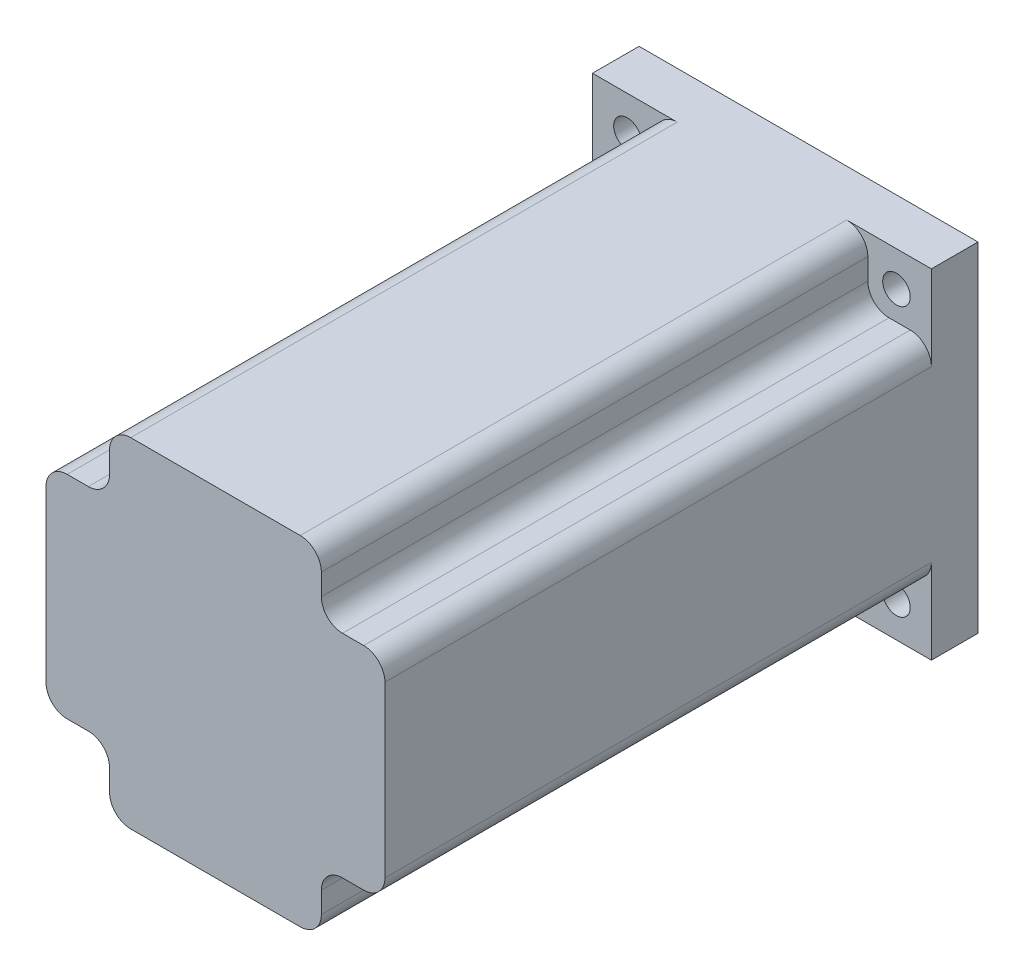
ISO-10303-21;
HEADER;
FILE_DESCRIPTION(('STEP AP214'),'2;1');
FILE_NAME('part.step','',(''),(''),'','','');
FILE_SCHEMA(('AUTOMOTIVE_DESIGN { 1 0 10303 214 1 1 1 1 }'));
ENDSEC;
DATA;
#1=APPLICATION_CONTEXT('core data for automotive mechanical design processes');
#2=APPLICATION_PROTOCOL_DEFINITION('international standard','automotive_design',2000,#1);
#3=PRODUCT_CONTEXT('',#1,'mechanical');
#4=PRODUCT('Part','Part','',(#3));
#5=PRODUCT_RELATED_PRODUCT_CATEGORY('part','',(#4));
#6=PRODUCT_DEFINITION_FORMATION('','',#4);
#7=PRODUCT_DEFINITION_CONTEXT('part definition',#1,'design');
#8=PRODUCT_DEFINITION('design','',#6,#7);
#9=PRODUCT_DEFINITION_SHAPE('','',#8);
#10=(LENGTH_UNIT() NAMED_UNIT(*) SI_UNIT(.MILLI.,.METRE.));
#11=(NAMED_UNIT(*) PLANE_ANGLE_UNIT() SI_UNIT($,.RADIAN.));
#12=(NAMED_UNIT(*) SI_UNIT($,.STERADIAN.) SOLID_ANGLE_UNIT());
#13=UNCERTAINTY_MEASURE_WITH_UNIT(LENGTH_MEASURE(1.E-05),#10,'distance_accuracy_value','');
#14=(GEOMETRIC_REPRESENTATION_CONTEXT(3) GLOBAL_UNCERTAINTY_ASSIGNED_CONTEXT((#13)) GLOBAL_UNIT_ASSIGNED_CONTEXT((#10,
#11,#12)) REPRESENTATION_CONTEXT('',''));
#15=CARTESIAN_POINT('',(0.,0.,0.));
#16=DIRECTION('',(0.,0.,1.));
#17=DIRECTION('',(1.,0.,0.));
#18=AXIS2_PLACEMENT_3D('',#15,#16,#17);
#19=CARTESIAN_POINT('',(-40.,-40.,140.));
#20=DIRECTION('',(1.,0.,0.));
#21=DIRECTION('',(0.,0.,-1.));
#22=AXIS2_PLACEMENT_3D('',#19,#20,#21);
#23=PLANE('',#22);
#24=DIRECTION('',(0.,0.,1.));
#25=VECTOR('',#24,1.);
#26=CARTESIAN_POINT('',(-40.,20.,11.));
#27=LINE('',#26,#25);
#28=CARTESIAN_POINT('',(-40.,20.,11.));
#29=VERTEX_POINT('',#28);
#30=CARTESIAN_POINT('',(-40.,20.,140.));
#31=VERTEX_POINT('',#30);
#32=EDGE_CURVE('E237',#29,#31,#27,.T.);
#33=ORIENTED_EDGE('',*,*,#32,.F.);
#34=DIRECTION('',(0.,-1.,0.));
#35=VECTOR('',#34,1.);
#36=CARTESIAN_POINT('',(-40.,-40.,11.));
#37=LINE('',#36,#35);
#38=CARTESIAN_POINT('',(-40.,40.,11.));
#39=VERTEX_POINT('',#38);
#40=EDGE_CURVE('E220',#39,#29,#37,.T.);
#41=ORIENTED_EDGE('',*,*,#40,.F.);
#42=DIRECTION('',(0.,0.,-1.));
#43=VECTOR('',#42,1.);
#44=CARTESIAN_POINT('',(-40.,40.,140.));
#45=LINE('',#44,#43);
#46=CARTESIAN_POINT('',(-40.,40.,0.));
#47=VERTEX_POINT('',#46);
#48=EDGE_CURVE('E287',#39,#47,#45,.T.);
#49=ORIENTED_EDGE('',*,*,#48,.T.);
#50=DIRECTION('',(0.,-1.,0.));
#51=VECTOR('',#50,1.);
#52=CARTESIAN_POINT('',(-40.,-40.,0.));
#53=LINE('',#52,#51);
#54=CARTESIAN_POINT('',(-40.,-40.,0.));
#55=VERTEX_POINT('',#54);
#56=EDGE_CURVE('E279',#47,#55,#53,.T.);
#57=ORIENTED_EDGE('',*,*,#56,.T.);
#58=DIRECTION('',(0.,0.,-1.));
#59=VECTOR('',#58,1.);
#60=CARTESIAN_POINT('',(-40.,-40.,140.));
#61=LINE('',#60,#59);
#62=CARTESIAN_POINT('',(-40.,-40.,11.));
#63=VERTEX_POINT('',#62);
#64=EDGE_CURVE('E285',#63,#55,#61,.T.);
#65=ORIENTED_EDGE('',*,*,#64,.F.);
#66=CARTESIAN_POINT('',(-40.,-20.,11.));
#67=VERTEX_POINT('',#66);
#68=EDGE_CURVE('E232',#67,#63,#37,.T.);
#69=ORIENTED_EDGE('',*,*,#68,.F.);
#70=DIRECTION('',(0.,0.,1.));
#71=VECTOR('',#70,1.);
#72=CARTESIAN_POINT('',(-40.,-20.,11.));
#73=LINE('',#72,#71);
#74=CARTESIAN_POINT('',(-40.,-20.,140.));
#75=VERTEX_POINT('',#74);
#76=EDGE_CURVE('E247',#67,#75,#73,.T.);
#77=ORIENTED_EDGE('',*,*,#76,.T.);
#78=DIRECTION('',(0.,-1.,0.));
#79=VECTOR('',#78,1.);
#80=CARTESIAN_POINT('',(-40.,-40.,140.));
#81=LINE('',#80,#79);
#82=EDGE_CURVE('E246',#31,#75,#81,.T.);
#83=ORIENTED_EDGE('',*,*,#82,.F.);
#84=EDGE_LOOP('',(#33,#41,#49,#57,#65,#69,#77,#83));
#85=FACE_BOUND('',#84,.T.);
#86=ADVANCED_FACE('F36',(#85),#23,.F.);
#87=CARTESIAN_POINT('',(0.,0.,140.));
#88=DIRECTION('',(0.,0.,-1.));
#89=DIRECTION('',(-1.,0.,0.));
#90=AXIS2_PLACEMENT_3D('',#87,#88,#89);
#91=PLANE('',#90);
#92=CARTESIAN_POINT('',(-35.,20.,140.));
#93=DIRECTION('',(0.,0.,1.));
#94=DIRECTION('',(1.,0.,0.));
#95=AXIS2_PLACEMENT_3D('',#92,#93,#94);
#96=CIRCLE('',#95,5.);
#97=CARTESIAN_POINT('',(-35.,25.,140.));
#98=VERTEX_POINT('',#97);
#99=EDGE_CURVE('E391',#98,#31,#96,.T.);
#100=ORIENTED_EDGE('',*,*,#99,.T.);
#101=ORIENTED_EDGE('',*,*,#82,.T.);
#102=CARTESIAN_POINT('',(-35.,-20.,140.));
#103=DIRECTION('',(0.,0.,1.));
#104=DIRECTION('',(-1.,0.,0.));
#105=AXIS2_PLACEMENT_3D('',#102,#103,#104);
#106=CIRCLE('',#105,5.);
#107=CARTESIAN_POINT('',(-35.,-25.,140.));
#108=VERTEX_POINT('',#107);
#109=EDGE_CURVE('E382',#75,#108,#106,.T.);
#110=ORIENTED_EDGE('',*,*,#109,.T.);
#111=DIRECTION('',(1.,0.,0.));
#112=VECTOR('',#111,1.);
#113=CARTESIAN_POINT('',(-30.,-25.,140.));
#114=LINE('',#113,#112);
#115=CARTESIAN_POINT('',(-30.,-25.,140.));
#116=VERTEX_POINT('',#115);
#117=EDGE_CURVE('E390',#108,#116,#114,.T.);
#118=ORIENTED_EDGE('',*,*,#117,.T.);
#119=CARTESIAN_POINT('',(-30.,-30.,140.));
#120=DIRECTION('',(0.,0.,-1.));
#121=DIRECTION('',(1.,0.,0.));
#122=AXIS2_PLACEMENT_3D('',#119,#120,#121);
#123=CIRCLE('',#122,5.);
#124=CARTESIAN_POINT('',(-25.,-30.,140.));
#125=VERTEX_POINT('',#124);
#126=EDGE_CURVE('E393',#116,#125,#123,.T.);
#127=ORIENTED_EDGE('',*,*,#126,.T.);
#128=DIRECTION('',(0.,-1.,0.));
#129=VECTOR('',#128,1.);
#130=CARTESIAN_POINT('',(-25.,-30.,140.));
#131=LINE('',#130,#129);
#132=CARTESIAN_POINT('',(-25.,-35.,140.));
#133=VERTEX_POINT('',#132);
#134=EDGE_CURVE('E399',#125,#133,#131,.T.);
#135=ORIENTED_EDGE('',*,*,#134,.T.);
#136=CARTESIAN_POINT('',(-20.,-35.,140.));
#137=DIRECTION('',(0.,0.,1.));
#138=DIRECTION('',(1.,0.,0.));
#139=AXIS2_PLACEMENT_3D('',#136,#137,#138);
#140=CIRCLE('',#139,5.);
#141=CARTESIAN_POINT('',(-20.,-40.,140.));
#142=VERTEX_POINT('',#141);
#143=EDGE_CURVE('E402',#133,#142,#140,.T.);
#144=ORIENTED_EDGE('',*,*,#143,.T.);
#145=DIRECTION('',(1.,0.,0.));
#146=VECTOR('',#145,1.);
#147=CARTESIAN_POINT('',(-40.,-40.,140.));
#148=LINE('',#147,#146);
#149=CARTESIAN_POINT('',(20.,-40.,140.));
#150=VERTEX_POINT('',#149);
#151=EDGE_CURVE('E269',#142,#150,#148,.T.);
#152=ORIENTED_EDGE('',*,*,#151,.T.);
#153=CARTESIAN_POINT('',(20.,-35.,140.));
#154=DIRECTION('',(0.,0.,1.));
#155=DIRECTION('',(-1.,0.,0.));
#156=AXIS2_PLACEMENT_3D('',#153,#154,#155);
#157=CIRCLE('',#156,5.);
#158=CARTESIAN_POINT('',(25.,-35.,140.));
#159=VERTEX_POINT('',#158);
#160=EDGE_CURVE('E405',#150,#159,#157,.T.);
#161=ORIENTED_EDGE('',*,*,#160,.T.);
#162=DIRECTION('',(0.,1.,0.));
#163=VECTOR('',#162,1.);
#164=CARTESIAN_POINT('',(25.,-30.0000000000001,140.));
#165=LINE('',#164,#163);
#166=CARTESIAN_POINT('',(25.,-30.0000000000001,140.));
#167=VERTEX_POINT('',#166);
#168=EDGE_CURVE('E408',#159,#167,#165,.T.);
#169=ORIENTED_EDGE('',*,*,#168,.T.);
#170=CARTESIAN_POINT('',(30.,-30.,140.));
#171=DIRECTION('',(0.,0.,-1.));
#172=DIRECTION('',(-1.,0.,0.));
#173=AXIS2_PLACEMENT_3D('',#170,#171,#172);
#174=CIRCLE('',#173,5.);
#175=CARTESIAN_POINT('',(30.,-25.0000000000001,140.));
#176=VERTEX_POINT('',#175);
#177=EDGE_CURVE('E411',#167,#176,#174,.T.);
#178=ORIENTED_EDGE('',*,*,#177,.T.);
#179=DIRECTION('',(1.,0.,0.));
#180=VECTOR('',#179,1.);
#181=CARTESIAN_POINT('',(30.,-25.0000000000001,140.));
#182=LINE('',#181,#180);
#183=CARTESIAN_POINT('',(35.,-25.0000000000001,140.));
#184=VERTEX_POINT('',#183);
#185=EDGE_CURVE('E414',#176,#184,#182,.T.);
#186=ORIENTED_EDGE('',*,*,#185,.T.);
#187=CARTESIAN_POINT('',(35.,-20.,140.));
#188=DIRECTION('',(0.,0.,1.));
#189=DIRECTION('',(1.,0.,0.));
#190=AXIS2_PLACEMENT_3D('',#187,#188,#189);
#191=CIRCLE('',#190,5.);
#192=CARTESIAN_POINT('',(40.,-20.,140.));
#193=VERTEX_POINT('',#192);
#194=EDGE_CURVE('E417',#184,#193,#191,.T.);
#195=ORIENTED_EDGE('',*,*,#194,.T.);
#196=DIRECTION('',(0.,1.,0.));
#197=VECTOR('',#196,1.);
#198=CARTESIAN_POINT('',(40.,-40.,140.));
#199=LINE('',#198,#197);
#200=CARTESIAN_POINT('',(40.,20.,140.));
#201=VERTEX_POINT('',#200);
#202=EDGE_CURVE('E261',#193,#201,#199,.T.);
#203=ORIENTED_EDGE('',*,*,#202,.T.);
#204=CARTESIAN_POINT('',(35.,20.0000000000001,140.));
#205=DIRECTION('',(0.,0.,1.));
#206=DIRECTION('',(-1.,0.,0.));
#207=AXIS2_PLACEMENT_3D('',#204,#205,#206);
#208=CIRCLE('',#207,5.);
#209=CARTESIAN_POINT('',(35.,25.,140.));
#210=VERTEX_POINT('',#209);
#211=EDGE_CURVE('E420',#201,#210,#208,.T.);
#212=ORIENTED_EDGE('',*,*,#211,.T.);
#213=DIRECTION('',(-1.,0.,0.));
#214=VECTOR('',#213,1.);
#215=CARTESIAN_POINT('',(30.,25.,140.));
#216=LINE('',#215,#214);
#217=CARTESIAN_POINT('',(30.,25.,140.));
#218=VERTEX_POINT('',#217);
#219=EDGE_CURVE('E59',#210,#218,#216,.T.);
#220=ORIENTED_EDGE('',*,*,#219,.T.);
#221=CARTESIAN_POINT('',(30.,30.,140.));
#222=DIRECTION('',(0.,0.,-1.));
#223=DIRECTION('',(-1.,0.,0.));
#224=AXIS2_PLACEMENT_3D('',#221,#222,#223);
#225=CIRCLE('',#224,5.);
#226=CARTESIAN_POINT('',(25.,30.0000000000001,140.));
#227=VERTEX_POINT('',#226);
#228=EDGE_CURVE('E424',#218,#227,#225,.T.);
#229=ORIENTED_EDGE('',*,*,#228,.T.);
#230=DIRECTION('',(0.,1.,0.));
#231=VECTOR('',#230,1.);
#232=CARTESIAN_POINT('',(25.,30.0000000000001,140.));
#233=LINE('',#232,#231);
#234=CARTESIAN_POINT('',(25.,35.,140.));
#235=VERTEX_POINT('',#234);
#236=EDGE_CURVE('E427',#227,#235,#233,.T.);
#237=ORIENTED_EDGE('',*,*,#236,.T.);
#238=CARTESIAN_POINT('',(20.,35.,140.));
#239=DIRECTION('',(0.,0.,1.));
#240=DIRECTION('',(1.,0.,0.));
#241=AXIS2_PLACEMENT_3D('',#238,#239,#240);
#242=CIRCLE('',#241,5.);
#243=CARTESIAN_POINT('',(20.,40.,140.));
#244=VERTEX_POINT('',#243);
#245=EDGE_CURVE('E430',#235,#244,#242,.T.);
#246=ORIENTED_EDGE('',*,*,#245,.T.);
#247=DIRECTION('',(-1.,0.,0.));
#248=VECTOR('',#247,1.);
#249=CARTESIAN_POINT('',(-40.,40.,140.));
#250=LINE('',#249,#248);
#251=CARTESIAN_POINT('',(-20.,40.,140.));
#252=VERTEX_POINT('',#251);
#253=EDGE_CURVE('E264',#244,#252,#250,.T.);
#254=ORIENTED_EDGE('',*,*,#253,.T.);
#255=CARTESIAN_POINT('',(-20.,35.,140.));
#256=DIRECTION('',(0.,0.,1.));
#257=DIRECTION('',(-1.,0.,0.));
#258=AXIS2_PLACEMENT_3D('',#255,#256,#257);
#259=CIRCLE('',#258,5.);
#260=CARTESIAN_POINT('',(-25.,35.,140.));
#261=VERTEX_POINT('',#260);
#262=EDGE_CURVE('E432',#252,#261,#259,.T.);
#263=ORIENTED_EDGE('',*,*,#262,.T.);
#264=DIRECTION('',(0.,-1.,0.));
#265=VECTOR('',#264,1.);
#266=CARTESIAN_POINT('',(-25.,30.,140.));
#267=LINE('',#266,#265);
#268=CARTESIAN_POINT('',(-25.,30.,140.));
#269=VERTEX_POINT('',#268);
#270=EDGE_CURVE('E51',#261,#269,#267,.T.);
#271=ORIENTED_EDGE('',*,*,#270,.T.);
#272=CARTESIAN_POINT('',(-30.,30.,140.));
#273=DIRECTION('',(0.,0.,-1.));
#274=DIRECTION('',(1.,0.,0.));
#275=AXIS2_PLACEMENT_3D('',#272,#273,#274);
#276=CIRCLE('',#275,5.);
#277=CARTESIAN_POINT('',(-30.,25.,140.));
#278=VERTEX_POINT('',#277);
#279=EDGE_CURVE('E436',#269,#278,#276,.T.);
#280=ORIENTED_EDGE('',*,*,#279,.T.);
#281=DIRECTION('',(-1.,0.,0.));
#282=VECTOR('',#281,1.);
#283=CARTESIAN_POINT('',(-30.,25.,140.));
#284=LINE('',#283,#282);
#285=EDGE_CURVE('E241',#278,#98,#284,.T.);
#286=ORIENTED_EDGE('',*,*,#285,.T.);
#287=EDGE_LOOP('',(#100,#101,#110,#118,#127,#135,#144,#152,#161,#169,#178,#186,#195,#203,#212,
#220,#229,#237,#246,#254,#263,#271,#280,#286));
#288=FACE_BOUND('',#287,.T.);
#289=ADVANCED_FACE('F388',(#288),#91,.F.);
#290=CARTESIAN_POINT('',(40.,-40.,140.));
#291=DIRECTION('',(-1.,0.,0.));
#292=DIRECTION('',(0.,0.,1.));
#293=AXIS2_PLACEMENT_3D('',#290,#291,#292);
#294=PLANE('',#293);
#295=DIRECTION('',(0.,0.,1.));
#296=VECTOR('',#295,1.);
#297=CARTESIAN_POINT('',(40.,-20.,11.));
#298=LINE('',#297,#296);
#299=CARTESIAN_POINT('',(40.,-20.,11.));
#300=VERTEX_POINT('',#299);
#301=EDGE_CURVE('E309',#300,#193,#298,.T.);
#302=ORIENTED_EDGE('',*,*,#301,.F.);
#303=DIRECTION('',(0.,1.,0.));
#304=VECTOR('',#303,1.);
#305=CARTESIAN_POINT('',(40.,-40.,11.));
#306=LINE('',#305,#304);
#307=CARTESIAN_POINT('',(40.,-40.,11.));
#308=VERTEX_POINT('',#307);
#309=EDGE_CURVE('E256',#308,#300,#306,.T.);
#310=ORIENTED_EDGE('',*,*,#309,.F.);
#311=DIRECTION('',(0.,0.,-1.));
#312=VECTOR('',#311,1.);
#313=CARTESIAN_POINT('',(40.,-40.,140.));
#314=LINE('',#313,#312);
#315=CARTESIAN_POINT('',(40.,-40.,0.));
#316=VERTEX_POINT('',#315);
#317=EDGE_CURVE('E272',#308,#316,#314,.T.);
#318=ORIENTED_EDGE('',*,*,#317,.T.);
#319=DIRECTION('',(0.,1.,0.));
#320=VECTOR('',#319,1.);
#321=CARTESIAN_POINT('',(40.,-40.,0.));
#322=LINE('',#321,#320);
#323=CARTESIAN_POINT('',(40.,40.,0.));
#324=VERTEX_POINT('',#323);
#325=EDGE_CURVE('E273',#316,#324,#322,.T.);
#326=ORIENTED_EDGE('',*,*,#325,.T.);
#327=DIRECTION('',(0.,0.,-1.));
#328=VECTOR('',#327,1.);
#329=CARTESIAN_POINT('',(40.,40.,140.));
#330=LINE('',#329,#328);
#331=CARTESIAN_POINT('',(40.,40.,11.));
#332=VERTEX_POINT('',#331);
#333=EDGE_CURVE('E288',#332,#324,#330,.T.);
#334=ORIENTED_EDGE('',*,*,#333,.F.);
#335=CARTESIAN_POINT('',(40.,20.,11.));
#336=VERTEX_POINT('',#335);
#337=EDGE_CURVE('E257',#336,#332,#306,.T.);
#338=ORIENTED_EDGE('',*,*,#337,.F.);
#339=DIRECTION('',(0.,0.,1.));
#340=VECTOR('',#339,1.);
#341=CARTESIAN_POINT('',(40.,20.,11.));
#342=LINE('',#341,#340);
#343=EDGE_CURVE('E321',#336,#201,#342,.T.);
#344=ORIENTED_EDGE('',*,*,#343,.T.);
#345=ORIENTED_EDGE('',*,*,#202,.F.);
#346=EDGE_LOOP('',(#302,#310,#318,#326,#334,#338,#344,#345));
#347=FACE_BOUND('',#346,.T.);
#348=ADVANCED_FACE('F38',(#347),#294,.F.);
#349=CARTESIAN_POINT('',(-40.,40.,140.));
#350=DIRECTION('',(0.,-1.,0.));
#351=DIRECTION('',(0.,0.,-1.));
#352=AXIS2_PLACEMENT_3D('',#349,#350,#351);
#353=PLANE('',#352);
#354=DIRECTION('',(0.,0.,1.));
#355=VECTOR('',#354,1.);
#356=CARTESIAN_POINT('',(20.,40.,11.));
#357=LINE('',#356,#355);
#358=CARTESIAN_POINT('',(20.,40.,11.));
#359=VERTEX_POINT('',#358);
#360=EDGE_CURVE('E334',#359,#244,#357,.T.);
#361=ORIENTED_EDGE('',*,*,#360,.F.);
#362=DIRECTION('',(-1.,0.,0.));
#363=VECTOR('',#362,1.);
#364=CARTESIAN_POINT('',(-40.,40.,11.));
#365=LINE('',#364,#363);
#366=EDGE_CURVE('E260',#332,#359,#365,.T.);
#367=ORIENTED_EDGE('',*,*,#366,.F.);
#368=ORIENTED_EDGE('',*,*,#333,.T.);
#369=DIRECTION('',(-1.,0.,0.));
#370=VECTOR('',#369,1.);
#371=CARTESIAN_POINT('',(-40.,40.,0.));
#372=LINE('',#371,#370);
#373=EDGE_CURVE('E276',#324,#47,#372,.T.);
#374=ORIENTED_EDGE('',*,*,#373,.T.);
#375=ORIENTED_EDGE('',*,*,#48,.F.);
#376=CARTESIAN_POINT('',(-20.,40.,11.));
#377=VERTEX_POINT('',#376);
#378=EDGE_CURVE('E228',#377,#39,#365,.T.);
#379=ORIENTED_EDGE('',*,*,#378,.F.);
#380=DIRECTION('',(0.,0.,1.));
#381=VECTOR('',#380,1.);
#382=CARTESIAN_POINT('',(-20.,40.,11.));
#383=LINE('',#382,#381);
#384=EDGE_CURVE('E343',#377,#252,#383,.T.);
#385=ORIENTED_EDGE('',*,*,#384,.T.);
#386=ORIENTED_EDGE('',*,*,#253,.F.);
#387=EDGE_LOOP('',(#361,#367,#368,#374,#375,#379,#385,#386));
#388=FACE_BOUND('',#387,.T.);
#389=ADVANCED_FACE('F341',(#388),#353,.F.);
#390=CARTESIAN_POINT('',(-40.,-40.,140.));
#391=DIRECTION('',(0.,1.,0.));
#392=DIRECTION('',(0.,0.,1.));
#393=AXIS2_PLACEMENT_3D('',#390,#391,#392);
#394=PLANE('',#393);
#395=DIRECTION('',(0.,0.,1.));
#396=VECTOR('',#395,1.);
#397=CARTESIAN_POINT('',(-20.,-40.,11.));
#398=LINE('',#397,#396);
#399=CARTESIAN_POINT('',(-20.,-40.,11.));
#400=VERTEX_POINT('',#399);
#401=EDGE_CURVE('E369',#400,#142,#398,.T.);
#402=ORIENTED_EDGE('',*,*,#401,.F.);
#403=DIRECTION('',(1.,0.,0.));
#404=VECTOR('',#403,1.);
#405=CARTESIAN_POINT('',(-40.,-40.,11.));
#406=LINE('',#405,#404);
#407=EDGE_CURVE('E12',#63,#400,#406,.T.);
#408=ORIENTED_EDGE('',*,*,#407,.F.);
#409=ORIENTED_EDGE('',*,*,#64,.T.);
#410=DIRECTION('',(1.,0.,0.));
#411=VECTOR('',#410,1.);
#412=CARTESIAN_POINT('',(-40.,-40.,0.));
#413=LINE('',#412,#411);
#414=EDGE_CURVE('E265',#55,#316,#413,.T.);
#415=ORIENTED_EDGE('',*,*,#414,.T.);
#416=ORIENTED_EDGE('',*,*,#317,.F.);
#417=CARTESIAN_POINT('',(20.,-40.,11.));
#418=VERTEX_POINT('',#417);
#419=EDGE_CURVE('E44',#418,#308,#406,.T.);
#420=ORIENTED_EDGE('',*,*,#419,.F.);
#421=DIRECTION('',(0.,0.,1.));
#422=VECTOR('',#421,1.);
#423=CARTESIAN_POINT('',(20.,-40.,11.));
#424=LINE('',#423,#422);
#425=EDGE_CURVE('E367',#418,#150,#424,.T.);
#426=ORIENTED_EDGE('',*,*,#425,.T.);
#427=ORIENTED_EDGE('',*,*,#151,.F.);
#428=EDGE_LOOP('',(#402,#408,#409,#415,#416,#420,#426,#427));
#429=FACE_BOUND('',#428,.T.);
#430=ADVANCED_FACE('F311',(#429),#394,.F.);
#431=CARTESIAN_POINT('',(0.,0.,0.));
#432=DIRECTION('',(0.,0.,-1.));
#433=DIRECTION('',(-1.,0.,0.));
#434=AXIS2_PLACEMENT_3D('',#431,#432,#433);
#435=PLANE('',#434);
#436=CARTESIAN_POINT('',(-31.75,31.75,0.));
#437=DIRECTION('',(0.,0.,1.));
#438=DIRECTION('',(1.,0.,0.));
#439=AXIS2_PLACEMENT_3D('',#436,#437,#438);
#440=CIRCLE('',#439,3.25);
#441=CARTESIAN_POINT('',(-28.5,31.75,0.));
#442=VERTEX_POINT('',#441);
#443=EDGE_CURVE('E743',#442,#442,#440,.T.);
#444=ORIENTED_EDGE('',*,*,#443,.T.);
#445=EDGE_LOOP('',(#444));
#446=FACE_BOUND('',#445,.T.);
#447=CARTESIAN_POINT('',(31.75,31.75,0.));
#448=DIRECTION('',(0.,0.,1.));
#449=DIRECTION('',(1.,0.,0.));
#450=AXIS2_PLACEMENT_3D('',#447,#448,#449);
#451=CIRCLE('',#450,3.25);
#452=CARTESIAN_POINT('',(35.,31.75,0.));
#453=VERTEX_POINT('',#452);
#454=EDGE_CURVE('E753',#453,#453,#451,.T.);
#455=ORIENTED_EDGE('',*,*,#454,.T.);
#456=EDGE_LOOP('',(#455));
#457=FACE_BOUND('',#456,.T.);
#458=CARTESIAN_POINT('',(31.75,-31.75,0.));
#459=DIRECTION('',(0.,0.,1.));
#460=DIRECTION('',(1.,0.,0.));
#461=AXIS2_PLACEMENT_3D('',#458,#459,#460);
#462=CIRCLE('',#461,3.25);
#463=CARTESIAN_POINT('',(35.,-31.75,0.));
#464=VERTEX_POINT('',#463);
#465=EDGE_CURVE('E759',#464,#464,#462,.T.);
#466=ORIENTED_EDGE('',*,*,#465,.T.);
#467=EDGE_LOOP('',(#466));
#468=FACE_BOUND('',#467,.T.);
#469=CARTESIAN_POINT('',(-31.75,-31.75,0.));
#470=DIRECTION('',(0.,0.,1.));
#471=DIRECTION('',(1.,0.,0.));
#472=AXIS2_PLACEMENT_3D('',#469,#470,#471);
#473=CIRCLE('',#472,3.25);
#474=CARTESIAN_POINT('',(-28.5,-31.75,0.));
#475=VERTEX_POINT('',#474);
#476=EDGE_CURVE('E395',#475,#475,#473,.T.);
#477=ORIENTED_EDGE('',*,*,#476,.T.);
#478=EDGE_LOOP('',(#477));
#479=FACE_BOUND('',#478,.T.);
#480=ORIENTED_EDGE('',*,*,#325,.F.);
#481=ORIENTED_EDGE('',*,*,#414,.F.);
#482=ORIENTED_EDGE('',*,*,#56,.F.);
#483=ORIENTED_EDGE('',*,*,#373,.F.);
#484=EDGE_LOOP('',(#480,#481,#482,#483));
#485=FACE_BOUND('',#484,.T.);
#486=ADVANCED_FACE('F318',(#446,#457,#468,#479,#485),#435,.T.);
#487=CARTESIAN_POINT('',(-35.,-20.,11.));
#488=DIRECTION('',(0.,0.,1.));
#489=DIRECTION('',(1.,0.,0.));
#490=AXIS2_PLACEMENT_3D('',#487,#488,#489);
#491=CYLINDRICAL_SURFACE('',#490,5.);
#492=ORIENTED_EDGE('',*,*,#109,.F.);
#493=ORIENTED_EDGE('',*,*,#76,.F.);
#494=CARTESIAN_POINT('',(-35.,-20.,11.));
#495=DIRECTION('',(0.,0.,1.));
#496=DIRECTION('',(-1.,0.,0.));
#497=AXIS2_PLACEMENT_3D('',#494,#495,#496);
#498=CIRCLE('',#497,5.);
#499=CARTESIAN_POINT('',(-35.,-25.,11.));
#500=VERTEX_POINT('',#499);
#501=EDGE_CURVE('E240',#67,#500,#498,.T.);
#502=ORIENTED_EDGE('',*,*,#501,.T.);
#503=DIRECTION('',(0.,0.,1.));
#504=VECTOR('',#503,1.);
#505=CARTESIAN_POINT('',(-35.,-25.,11.));
#506=LINE('',#505,#504);
#507=EDGE_CURVE('E250',#500,#108,#506,.T.);
#508=ORIENTED_EDGE('',*,*,#507,.T.);
#509=EDGE_LOOP('',(#492,#493,#502,#508));
#510=FACE_BOUND('',#509,.T.);
#511=ADVANCED_FACE('F380',(#510),#491,.T.);
#512=CARTESIAN_POINT('',(-30.,-25.,11.));
#513=DIRECTION('',(0.,-1.,0.));
#514=DIRECTION('',(0.,0.,-1.));
#515=AXIS2_PLACEMENT_3D('',#512,#513,#514);
#516=PLANE('',#515);
#517=ORIENTED_EDGE('',*,*,#117,.F.);
#518=ORIENTED_EDGE('',*,*,#507,.F.);
#519=DIRECTION('',(1.,0.,0.));
#520=VECTOR('',#519,1.);
#521=CARTESIAN_POINT('',(-30.,-25.,11.));
#522=LINE('',#521,#520);
#523=CARTESIAN_POINT('',(-30.,-25.,11.));
#524=VERTEX_POINT('',#523);
#525=EDGE_CURVE('E768',#500,#524,#522,.T.);
#526=ORIENTED_EDGE('',*,*,#525,.T.);
#527=DIRECTION('',(0.,0.,1.));
#528=VECTOR('',#527,1.);
#529=CARTESIAN_POINT('',(-30.,-25.,11.));
#530=LINE('',#529,#528);
#531=EDGE_CURVE('E375',#524,#116,#530,.T.);
#532=ORIENTED_EDGE('',*,*,#531,.T.);
#533=EDGE_LOOP('',(#517,#518,#526,#532));
#534=FACE_BOUND('',#533,.T.);
#535=ADVANCED_FACE('F517',(#534),#516,.T.);
#536=CARTESIAN_POINT('',(-30.,-30.,11.));
#537=DIRECTION('',(0.,0.,1.));
#538=DIRECTION('',(1.,0.,0.));
#539=AXIS2_PLACEMENT_3D('',#536,#537,#538);
#540=CYLINDRICAL_SURFACE('',#539,5.);
#541=ORIENTED_EDGE('',*,*,#126,.F.);
#542=ORIENTED_EDGE('',*,*,#531,.F.);
#543=CARTESIAN_POINT('',(-30.,-30.,11.));
#544=DIRECTION('',(0.,0.,-1.));
#545=DIRECTION('',(1.,0.,0.));
#546=AXIS2_PLACEMENT_3D('',#543,#544,#545);
#547=CIRCLE('',#546,5.);
#548=CARTESIAN_POINT('',(-25.,-30.,11.));
#549=VERTEX_POINT('',#548);
#550=EDGE_CURVE('E770',#524,#549,#547,.T.);
#551=ORIENTED_EDGE('',*,*,#550,.T.);
#552=DIRECTION('',(0.,0.,1.));
#553=VECTOR('',#552,1.);
#554=CARTESIAN_POINT('',(-25.,-30.,11.));
#555=LINE('',#554,#553);
#556=EDGE_CURVE('E373',#549,#125,#555,.T.);
#557=ORIENTED_EDGE('',*,*,#556,.T.);
#558=EDGE_LOOP('',(#541,#542,#551,#557));
#559=FACE_BOUND('',#558,.T.);
#560=ADVANCED_FACE('F526',(#559),#540,.F.);
#561=CARTESIAN_POINT('',(-25.,-30.,11.));
#562=DIRECTION('',(-1.,0.,0.));
#563=DIRECTION('',(0.,0.,1.));
#564=AXIS2_PLACEMENT_3D('',#561,#562,#563);
#565=PLANE('',#564);
#566=ORIENTED_EDGE('',*,*,#134,.F.);
#567=ORIENTED_EDGE('',*,*,#556,.F.);
#568=DIRECTION('',(0.,-1.,0.));
#569=VECTOR('',#568,1.);
#570=CARTESIAN_POINT('',(-25.,-30.,11.));
#571=LINE('',#570,#569);
#572=CARTESIAN_POINT('',(-25.,-35.,11.));
#573=VERTEX_POINT('',#572);
#574=EDGE_CURVE('E773',#549,#573,#571,.T.);
#575=ORIENTED_EDGE('',*,*,#574,.T.);
#576=DIRECTION('',(0.,0.,1.));
#577=VECTOR('',#576,1.);
#578=CARTESIAN_POINT('',(-25.,-35.,11.));
#579=LINE('',#578,#577);
#580=EDGE_CURVE('E371',#573,#133,#579,.T.);
#581=ORIENTED_EDGE('',*,*,#580,.T.);
#582=EDGE_LOOP('',(#566,#567,#575,#581));
#583=FACE_BOUND('',#582,.T.);
#584=ADVANCED_FACE('F534',(#583),#565,.T.);
#585=CARTESIAN_POINT('',(-20.,-35.,11.));
#586=DIRECTION('',(0.,0.,1.));
#587=DIRECTION('',(1.,0.,0.));
#588=AXIS2_PLACEMENT_3D('',#585,#586,#587);
#589=CYLINDRICAL_SURFACE('',#588,5.);
#590=ORIENTED_EDGE('',*,*,#143,.F.);
#591=ORIENTED_EDGE('',*,*,#580,.F.);
#592=CARTESIAN_POINT('',(-20.,-35.,11.));
#593=DIRECTION('',(0.,0.,1.));
#594=DIRECTION('',(1.,0.,0.));
#595=AXIS2_PLACEMENT_3D('',#592,#593,#594);
#596=CIRCLE('',#595,5.);
#597=EDGE_CURVE('E776',#573,#400,#596,.T.);
#598=ORIENTED_EDGE('',*,*,#597,.T.);
#599=ORIENTED_EDGE('',*,*,#401,.T.);
#600=EDGE_LOOP('',(#590,#591,#598,#599));
#601=FACE_BOUND('',#600,.T.);
#602=ADVANCED_FACE('F543',(#601),#589,.T.);
#603=CARTESIAN_POINT('',(8.29900689189397,14.6666085434931,11.));
#604=DIRECTION('',(0.,0.,1.));
#605=DIRECTION('',(1.,0.,0.));
#606=AXIS2_PLACEMENT_3D('',#603,#604,#605);
#607=PLANE('',#606);
#608=CARTESIAN_POINT('',(-31.75,-31.75,11.));
#609=DIRECTION('',(0.,0.,1.));
#610=DIRECTION('',(1.,0.,0.));
#611=AXIS2_PLACEMENT_3D('',#608,#609,#610);
#612=CIRCLE('',#611,3.25);
#613=CARTESIAN_POINT('',(-28.5,-31.75,11.));
#614=VERTEX_POINT('',#613);
#615=EDGE_CURVE('E762',#614,#614,#612,.T.);
#616=ORIENTED_EDGE('',*,*,#615,.F.);
#617=EDGE_LOOP('',(#616));
#618=FACE_BOUND('',#617,.T.);
#619=ORIENTED_EDGE('',*,*,#68,.T.);
#620=ORIENTED_EDGE('',*,*,#407,.T.);
#621=ORIENTED_EDGE('',*,*,#597,.F.);
#622=ORIENTED_EDGE('',*,*,#574,.F.);
#623=ORIENTED_EDGE('',*,*,#550,.F.);
#624=ORIENTED_EDGE('',*,*,#525,.F.);
#625=ORIENTED_EDGE('',*,*,#501,.F.);
#626=EDGE_LOOP('',(#619,#620,#621,#622,#623,#624,#625));
#627=FACE_BOUND('',#626,.T.);
#628=ADVANCED_FACE('F552',(#618,#627),#607,.T.);
#629=CARTESIAN_POINT('',(20.,-35.,11.));
#630=DIRECTION('',(0.,0.,1.));
#631=DIRECTION('',(1.,0.,0.));
#632=AXIS2_PLACEMENT_3D('',#629,#630,#631);
#633=CYLINDRICAL_SURFACE('',#632,5.);
#634=ORIENTED_EDGE('',*,*,#160,.F.);
#635=ORIENTED_EDGE('',*,*,#425,.F.);
#636=CARTESIAN_POINT('',(20.,-35.,11.));
#637=DIRECTION('',(0.,0.,1.));
#638=DIRECTION('',(-1.,0.,0.));
#639=AXIS2_PLACEMENT_3D('',#636,#637,#638);
#640=CIRCLE('',#639,5.);
#641=CARTESIAN_POINT('',(25.,-35.,11.));
#642=VERTEX_POINT('',#641);
#643=EDGE_CURVE('E302',#418,#642,#640,.T.);
#644=ORIENTED_EDGE('',*,*,#643,.T.);
#645=DIRECTION('',(0.,0.,1.));
#646=VECTOR('',#645,1.);
#647=CARTESIAN_POINT('',(25.,-35.,11.));
#648=LINE('',#647,#646);
#649=EDGE_CURVE('E364',#642,#159,#648,.T.);
#650=ORIENTED_EDGE('',*,*,#649,.T.);
#651=EDGE_LOOP('',(#634,#635,#644,#650));
#652=FACE_BOUND('',#651,.T.);
#653=ADVANCED_FACE('F562',(#652),#633,.T.);
#654=CARTESIAN_POINT('',(25.,-30.0000000000001,11.));
#655=DIRECTION('',(1.,0.,0.));
#656=DIRECTION('',(0.,0.,-1.));
#657=AXIS2_PLACEMENT_3D('',#654,#655,#656);
#658=PLANE('',#657);
#659=ORIENTED_EDGE('',*,*,#168,.F.);
#660=ORIENTED_EDGE('',*,*,#649,.F.);
#661=DIRECTION('',(0.,1.,0.));
#662=VECTOR('',#661,1.);
#663=CARTESIAN_POINT('',(25.,-30.0000000000001,11.));
#664=LINE('',#663,#662);
#665=CARTESIAN_POINT('',(25.,-30.0000000000001,11.));
#666=VERTEX_POINT('',#665);
#667=EDGE_CURVE('E780',#642,#666,#664,.T.);
#668=ORIENTED_EDGE('',*,*,#667,.T.);
#669=DIRECTION('',(0.,0.,1.));
#670=VECTOR('',#669,1.);
#671=CARTESIAN_POINT('',(25.,-30.0000000000001,11.));
#672=LINE('',#671,#670);
#673=EDGE_CURVE('E362',#666,#167,#672,.T.);
#674=ORIENTED_EDGE('',*,*,#673,.T.);
#675=EDGE_LOOP('',(#659,#660,#668,#674));
#676=FACE_BOUND('',#675,.T.);
#677=ADVANCED_FACE('F572',(#676),#658,.T.);
#678=CARTESIAN_POINT('',(30.,-30.,11.));
#679=DIRECTION('',(0.,0.,1.));
#680=DIRECTION('',(1.,0.,0.));
#681=AXIS2_PLACEMENT_3D('',#678,#679,#680);
#682=CYLINDRICAL_SURFACE('',#681,5.);
#683=ORIENTED_EDGE('',*,*,#177,.F.);
#684=ORIENTED_EDGE('',*,*,#673,.F.);
#685=CARTESIAN_POINT('',(30.,-30.,11.));
#686=DIRECTION('',(0.,0.,-1.));
#687=DIRECTION('',(-1.,0.,0.));
#688=AXIS2_PLACEMENT_3D('',#685,#686,#687);
#689=CIRCLE('',#688,5.);
#690=CARTESIAN_POINT('',(30.,-25.0000000000001,11.));
#691=VERTEX_POINT('',#690);
#692=EDGE_CURVE('E783',#666,#691,#689,.T.);
#693=ORIENTED_EDGE('',*,*,#692,.T.);
#694=DIRECTION('',(0.,0.,1.));
#695=VECTOR('',#694,1.);
#696=CARTESIAN_POINT('',(30.,-25.0000000000001,11.));
#697=LINE('',#696,#695);
#698=EDGE_CURVE('E360',#691,#176,#697,.T.);
#699=ORIENTED_EDGE('',*,*,#698,.T.);
#700=EDGE_LOOP('',(#683,#684,#693,#699));
#701=FACE_BOUND('',#700,.T.);
#702=ADVANCED_FACE('F581',(#701),#682,.F.);
#703=CARTESIAN_POINT('',(30.,-25.0000000000001,11.));
#704=DIRECTION('',(0.,-1.,0.));
#705=DIRECTION('',(0.,0.,-1.));
#706=AXIS2_PLACEMENT_3D('',#703,#704,#705);
#707=PLANE('',#706);
#708=ORIENTED_EDGE('',*,*,#185,.F.);
#709=ORIENTED_EDGE('',*,*,#698,.F.);
#710=DIRECTION('',(1.,0.,0.));
#711=VECTOR('',#710,1.);
#712=CARTESIAN_POINT('',(30.,-25.0000000000001,11.));
#713=LINE('',#712,#711);
#714=CARTESIAN_POINT('',(35.,-25.0000000000001,11.));
#715=VERTEX_POINT('',#714);
#716=EDGE_CURVE('E786',#691,#715,#713,.T.);
#717=ORIENTED_EDGE('',*,*,#716,.T.);
#718=DIRECTION('',(0.,0.,1.));
#719=VECTOR('',#718,1.);
#720=CARTESIAN_POINT('',(35.,-25.0000000000001,11.));
#721=LINE('',#720,#719);
#722=EDGE_CURVE('E358',#715,#184,#721,.T.);
#723=ORIENTED_EDGE('',*,*,#722,.T.);
#724=EDGE_LOOP('',(#708,#709,#717,#723));
#725=FACE_BOUND('',#724,.T.);
#726=ADVANCED_FACE('F590',(#725),#707,.T.);
#727=CARTESIAN_POINT('',(35.,-20.,11.));
#728=DIRECTION('',(0.,0.,1.));
#729=DIRECTION('',(1.,0.,0.));
#730=AXIS2_PLACEMENT_3D('',#727,#728,#729);
#731=CYLINDRICAL_SURFACE('',#730,5.);
#732=ORIENTED_EDGE('',*,*,#194,.F.);
#733=ORIENTED_EDGE('',*,*,#722,.F.);
#734=CARTESIAN_POINT('',(35.,-20.,11.));
#735=DIRECTION('',(0.,0.,1.));
#736=DIRECTION('',(1.,0.,0.));
#737=AXIS2_PLACEMENT_3D('',#734,#735,#736);
#738=CIRCLE('',#737,5.);
#739=EDGE_CURVE('E789',#715,#300,#738,.T.);
#740=ORIENTED_EDGE('',*,*,#739,.T.);
#741=ORIENTED_EDGE('',*,*,#301,.T.);
#742=EDGE_LOOP('',(#732,#733,#740,#741));
#743=FACE_BOUND('',#742,.T.);
#744=ADVANCED_FACE('F599',(#743),#731,.T.);
#745=CARTESIAN_POINT('',(31.75,-31.75,11.));
#746=DIRECTION('',(0.,0.,1.));
#747=DIRECTION('',(1.,0.,0.));
#748=AXIS2_PLACEMENT_3D('',#745,#746,#747);
#749=CIRCLE('',#748,3.25);
#750=CARTESIAN_POINT('',(35.,-31.75,11.));
#751=VERTEX_POINT('',#750);
#752=EDGE_CURVE('E756',#751,#751,#749,.T.);
#753=ORIENTED_EDGE('',*,*,#752,.F.);
#754=EDGE_LOOP('',(#753));
#755=FACE_BOUND('',#754,.T.);
#756=ORIENTED_EDGE('',*,*,#309,.T.);
#757=ORIENTED_EDGE('',*,*,#739,.F.);
#758=ORIENTED_EDGE('',*,*,#716,.F.);
#759=ORIENTED_EDGE('',*,*,#692,.F.);
#760=ORIENTED_EDGE('',*,*,#667,.F.);
#761=ORIENTED_EDGE('',*,*,#643,.F.);
#762=ORIENTED_EDGE('',*,*,#419,.T.);
#763=EDGE_LOOP('',(#756,#757,#758,#759,#760,#761,#762));
#764=FACE_BOUND('',#763,.T.);
#765=ADVANCED_FACE('F297',(#755,#764),#607,.T.);
#766=CARTESIAN_POINT('',(35.,20.0000000000001,11.));
#767=DIRECTION('',(0.,0.,1.));
#768=DIRECTION('',(1.,0.,0.));
#769=AXIS2_PLACEMENT_3D('',#766,#767,#768);
#770=CYLINDRICAL_SURFACE('',#769,5.);
#771=ORIENTED_EDGE('',*,*,#211,.F.);
#772=ORIENTED_EDGE('',*,*,#343,.F.);
#773=CARTESIAN_POINT('',(35.,20.0000000000001,11.));
#774=DIRECTION('',(0.,0.,1.));
#775=DIRECTION('',(-1.,0.,0.));
#776=AXIS2_PLACEMENT_3D('',#773,#774,#775);
#777=CIRCLE('',#776,5.);
#778=CARTESIAN_POINT('',(35.,25.,11.));
#779=VERTEX_POINT('',#778);
#780=EDGE_CURVE('E791',#336,#779,#777,.T.);
#781=ORIENTED_EDGE('',*,*,#780,.T.);
#782=DIRECTION('',(0.,0.,1.));
#783=VECTOR('',#782,1.);
#784=CARTESIAN_POINT('',(35.,25.,11.));
#785=LINE('',#784,#783);
#786=EDGE_CURVE('E354',#779,#210,#785,.T.);
#787=ORIENTED_EDGE('',*,*,#786,.T.);
#788=EDGE_LOOP('',(#771,#772,#781,#787));
#789=FACE_BOUND('',#788,.T.);
#790=ADVANCED_FACE('F616',(#789),#770,.T.);
#791=CARTESIAN_POINT('',(30.,25.,11.));
#792=DIRECTION('',(0.,1.,0.));
#793=DIRECTION('',(0.,0.,1.));
#794=AXIS2_PLACEMENT_3D('',#791,#792,#793);
#795=PLANE('',#794);
#796=ORIENTED_EDGE('',*,*,#219,.F.);
#797=ORIENTED_EDGE('',*,*,#786,.F.);
#798=DIRECTION('',(-1.,0.,0.));
#799=VECTOR('',#798,1.);
#800=CARTESIAN_POINT('',(30.,25.,11.));
#801=LINE('',#800,#799);
#802=CARTESIAN_POINT('',(30.,25.,11.));
#803=VERTEX_POINT('',#802);
#804=EDGE_CURVE('E458',#779,#803,#801,.T.);
#805=ORIENTED_EDGE('',*,*,#804,.T.);
#806=DIRECTION('',(0.,0.,1.));
#807=VECTOR('',#806,1.);
#808=CARTESIAN_POINT('',(30.,25.,11.));
#809=LINE('',#808,#807);
#810=EDGE_CURVE('E352',#803,#218,#809,.T.);
#811=ORIENTED_EDGE('',*,*,#810,.T.);
#812=EDGE_LOOP('',(#796,#797,#805,#811));
#813=FACE_BOUND('',#812,.T.);
#814=ADVANCED_FACE('F624',(#813),#795,.T.);
#815=CARTESIAN_POINT('',(30.,30.,11.));
#816=DIRECTION('',(0.,0.,1.));
#817=DIRECTION('',(1.,0.,0.));
#818=AXIS2_PLACEMENT_3D('',#815,#816,#817);
#819=CYLINDRICAL_SURFACE('',#818,5.);
#820=ORIENTED_EDGE('',*,*,#228,.F.);
#821=ORIENTED_EDGE('',*,*,#810,.F.);
#822=CARTESIAN_POINT('',(30.,30.,11.));
#823=DIRECTION('',(0.,0.,-1.));
#824=DIRECTION('',(-1.,0.,0.));
#825=AXIS2_PLACEMENT_3D('',#822,#823,#824);
#826=CIRCLE('',#825,5.);
#827=CARTESIAN_POINT('',(25.,30.0000000000001,11.));
#828=VERTEX_POINT('',#827);
#829=EDGE_CURVE('E456',#803,#828,#826,.T.);
#830=ORIENTED_EDGE('',*,*,#829,.T.);
#831=DIRECTION('',(0.,0.,1.));
#832=VECTOR('',#831,1.);
#833=CARTESIAN_POINT('',(25.,30.0000000000001,11.));
#834=LINE('',#833,#832);
#835=EDGE_CURVE('E347',#828,#227,#834,.T.);
#836=ORIENTED_EDGE('',*,*,#835,.T.);
#837=EDGE_LOOP('',(#820,#821,#830,#836));
#838=FACE_BOUND('',#837,.T.);
#839=ADVANCED_FACE('F633',(#838),#819,.F.);
#840=CARTESIAN_POINT('',(25.,30.0000000000001,11.));
#841=DIRECTION('',(1.,0.,0.));
#842=DIRECTION('',(0.,0.,-1.));
#843=AXIS2_PLACEMENT_3D('',#840,#841,#842);
#844=PLANE('',#843);
#845=ORIENTED_EDGE('',*,*,#236,.F.);
#846=ORIENTED_EDGE('',*,*,#835,.F.);
#847=DIRECTION('',(0.,1.,0.));
#848=VECTOR('',#847,1.);
#849=CARTESIAN_POINT('',(25.,30.0000000000001,11.));
#850=LINE('',#849,#848);
#851=CARTESIAN_POINT('',(25.,35.,11.));
#852=VERTEX_POINT('',#851);
#853=EDGE_CURVE('E338',#828,#852,#850,.T.);
#854=ORIENTED_EDGE('',*,*,#853,.T.);
#855=DIRECTION('',(0.,0.,1.));
#856=VECTOR('',#855,1.);
#857=CARTESIAN_POINT('',(25.,35.,11.));
#858=LINE('',#857,#856);
#859=EDGE_CURVE('E336',#852,#235,#858,.T.);
#860=ORIENTED_EDGE('',*,*,#859,.T.);
#861=EDGE_LOOP('',(#845,#846,#854,#860));
#862=FACE_BOUND('',#861,.T.);
#863=ADVANCED_FACE('F453',(#862),#844,.T.);
#864=CARTESIAN_POINT('',(20.,35.,11.));
#865=DIRECTION('',(0.,0.,1.));
#866=DIRECTION('',(1.,0.,0.));
#867=AXIS2_PLACEMENT_3D('',#864,#865,#866);
#868=CYLINDRICAL_SURFACE('',#867,5.);
#869=ORIENTED_EDGE('',*,*,#245,.F.);
#870=ORIENTED_EDGE('',*,*,#859,.F.);
#871=CARTESIAN_POINT('',(20.,35.,11.));
#872=DIRECTION('',(0.,0.,1.));
#873=DIRECTION('',(1.,0.,0.));
#874=AXIS2_PLACEMENT_3D('',#871,#872,#873);
#875=CIRCLE('',#874,5.);
#876=EDGE_CURVE('E328',#852,#359,#875,.T.);
#877=ORIENTED_EDGE('',*,*,#876,.T.);
#878=ORIENTED_EDGE('',*,*,#360,.T.);
#879=EDGE_LOOP('',(#869,#870,#877,#878));
#880=FACE_BOUND('',#879,.T.);
#881=ADVANCED_FACE('F333',(#880),#868,.T.);
#882=CARTESIAN_POINT('',(31.75,31.75,11.));
#883=DIRECTION('',(0.,0.,1.));
#884=DIRECTION('',(1.,0.,0.));
#885=AXIS2_PLACEMENT_3D('',#882,#883,#884);
#886=CIRCLE('',#885,3.25);
#887=CARTESIAN_POINT('',(35.,31.75,11.));
#888=VERTEX_POINT('',#887);
#889=EDGE_CURVE('E748',#888,#888,#886,.T.);
#890=ORIENTED_EDGE('',*,*,#889,.F.);
#891=EDGE_LOOP('',(#890));
#892=FACE_BOUND('',#891,.T.);
#893=ORIENTED_EDGE('',*,*,#337,.T.);
#894=ORIENTED_EDGE('',*,*,#366,.T.);
#895=ORIENTED_EDGE('',*,*,#876,.F.);
#896=ORIENTED_EDGE('',*,*,#853,.F.);
#897=ORIENTED_EDGE('',*,*,#829,.F.);
#898=ORIENTED_EDGE('',*,*,#804,.F.);
#899=ORIENTED_EDGE('',*,*,#780,.F.);
#900=EDGE_LOOP('',(#893,#894,#895,#896,#897,#898,#899));
#901=FACE_BOUND('',#900,.T.);
#902=ADVANCED_FACE('F326',(#892,#901),#607,.T.);
#903=CARTESIAN_POINT('',(-31.75,31.75,11.));
#904=DIRECTION('',(0.,0.,1.));
#905=DIRECTION('',(1.,0.,0.));
#906=AXIS2_PLACEMENT_3D('',#903,#904,#905);
#907=CIRCLE('',#906,3.25);
#908=CARTESIAN_POINT('',(-28.5,31.75,11.));
#909=VERTEX_POINT('',#908);
#910=EDGE_CURVE('E746',#909,#909,#907,.T.);
#911=ORIENTED_EDGE('',*,*,#910,.F.);
#912=EDGE_LOOP('',(#911));
#913=FACE_BOUND('',#912,.T.);
#914=ORIENTED_EDGE('',*,*,#378,.T.);
#915=ORIENTED_EDGE('',*,*,#40,.T.);
#916=CARTESIAN_POINT('',(-35.,20.,11.));
#917=DIRECTION('',(0.,0.,1.));
#918=DIRECTION('',(1.,0.,0.));
#919=AXIS2_PLACEMENT_3D('',#916,#917,#918);
#920=CIRCLE('',#919,5.);
#921=CARTESIAN_POINT('',(-35.,25.,11.));
#922=VERTEX_POINT('',#921);
#923=EDGE_CURVE('E224',#922,#29,#920,.T.);
#924=ORIENTED_EDGE('',*,*,#923,.F.);
#925=DIRECTION('',(-1.,0.,0.));
#926=VECTOR('',#925,1.);
#927=CARTESIAN_POINT('',(-30.,25.,11.));
#928=LINE('',#927,#926);
#929=CARTESIAN_POINT('',(-30.,25.,11.));
#930=VERTEX_POINT('',#929);
#931=EDGE_CURVE('E248',#930,#922,#928,.T.);
#932=ORIENTED_EDGE('',*,*,#931,.F.);
#933=CARTESIAN_POINT('',(-30.,30.,11.));
#934=DIRECTION('',(0.,0.,-1.));
#935=DIRECTION('',(1.,0.,0.));
#936=AXIS2_PLACEMENT_3D('',#933,#934,#935);
#937=CIRCLE('',#936,5.);
#938=CARTESIAN_POINT('',(-25.,30.,11.));
#939=VERTEX_POINT('',#938);
#940=EDGE_CURVE('E252',#939,#930,#937,.T.);
#941=ORIENTED_EDGE('',*,*,#940,.F.);
#942=DIRECTION('',(0.,-1.,0.));
#943=VECTOR('',#942,1.);
#944=CARTESIAN_POINT('',(-25.,30.,11.));
#945=LINE('',#944,#943);
#946=CARTESIAN_POINT('',(-25.,35.,11.));
#947=VERTEX_POINT('',#946);
#948=EDGE_CURVE('E463',#947,#939,#945,.T.);
#949=ORIENTED_EDGE('',*,*,#948,.F.);
#950=CARTESIAN_POINT('',(-20.,35.,11.));
#951=DIRECTION('',(0.,0.,1.));
#952=DIRECTION('',(-1.,0.,0.));
#953=AXIS2_PLACEMENT_3D('',#950,#951,#952);
#954=CIRCLE('',#953,5.);
#955=EDGE_CURVE('E337',#377,#947,#954,.T.);
#956=ORIENTED_EDGE('',*,*,#955,.F.);
#957=EDGE_LOOP('',(#914,#915,#924,#932,#941,#949,#956));
#958=FACE_BOUND('',#957,.T.);
#959=ADVANCED_FACE('F222',(#913,#958),#607,.T.);
#960=CARTESIAN_POINT('',(-35.,20.,11.));
#961=DIRECTION('',(0.,0.,1.));
#962=DIRECTION('',(1.,0.,0.));
#963=AXIS2_PLACEMENT_3D('',#960,#961,#962);
#964=CYLINDRICAL_SURFACE('',#963,5.);
#965=ORIENTED_EDGE('',*,*,#99,.F.);
#966=DIRECTION('',(0.,0.,1.));
#967=VECTOR('',#966,1.);
#968=CARTESIAN_POINT('',(-35.,25.,11.));
#969=LINE('',#968,#967);
#970=EDGE_CURVE('E239',#922,#98,#969,.T.);
#971=ORIENTED_EDGE('',*,*,#970,.F.);
#972=ORIENTED_EDGE('',*,*,#923,.T.);
#973=ORIENTED_EDGE('',*,*,#32,.T.);
#974=EDGE_LOOP('',(#965,#971,#972,#973));
#975=FACE_BOUND('',#974,.T.);
#976=ADVANCED_FACE('F236',(#975),#964,.T.);
#977=CARTESIAN_POINT('',(-30.,25.,11.));
#978=DIRECTION('',(0.,1.,0.));
#979=DIRECTION('',(0.,0.,1.));
#980=AXIS2_PLACEMENT_3D('',#977,#978,#979);
#981=PLANE('',#980);
#982=ORIENTED_EDGE('',*,*,#285,.F.);
#983=DIRECTION('',(0.,0.,1.));
#984=VECTOR('',#983,1.);
#985=CARTESIAN_POINT('',(-30.,25.,11.));
#986=LINE('',#985,#984);
#987=EDGE_CURVE('E442',#930,#278,#986,.T.);
#988=ORIENTED_EDGE('',*,*,#987,.F.);
#989=ORIENTED_EDGE('',*,*,#931,.T.);
#990=ORIENTED_EDGE('',*,*,#970,.T.);
#991=EDGE_LOOP('',(#982,#988,#989,#990));
#992=FACE_BOUND('',#991,.T.);
#993=ADVANCED_FACE('F473',(#992),#981,.T.);
#994=CARTESIAN_POINT('',(-30.,30.,11.));
#995=DIRECTION('',(0.,0.,1.));
#996=DIRECTION('',(1.,0.,0.));
#997=AXIS2_PLACEMENT_3D('',#994,#995,#996);
#998=CYLINDRICAL_SURFACE('',#997,5.);
#999=ORIENTED_EDGE('',*,*,#279,.F.);
#1000=DIRECTION('',(0.,0.,1.));
#1001=VECTOR('',#1000,1.);
#1002=CARTESIAN_POINT('',(-25.,30.,11.));
#1003=LINE('',#1002,#1001);
#1004=EDGE_CURVE('E444',#939,#269,#1003,.T.);
#1005=ORIENTED_EDGE('',*,*,#1004,.F.);
#1006=ORIENTED_EDGE('',*,*,#940,.T.);
#1007=ORIENTED_EDGE('',*,*,#987,.T.);
#1008=EDGE_LOOP('',(#999,#1005,#1006,#1007));
#1009=FACE_BOUND('',#1008,.T.);
#1010=ADVANCED_FACE('F469',(#1009),#998,.F.);
#1011=CARTESIAN_POINT('',(-25.,30.,11.));
#1012=DIRECTION('',(-1.,0.,0.));
#1013=DIRECTION('',(0.,0.,1.));
#1014=AXIS2_PLACEMENT_3D('',#1011,#1012,#1013);
#1015=PLANE('',#1014);
#1016=ORIENTED_EDGE('',*,*,#270,.F.);
#1017=DIRECTION('',(0.,0.,1.));
#1018=VECTOR('',#1017,1.);
#1019=CARTESIAN_POINT('',(-25.,35.,11.));
#1020=LINE('',#1019,#1018);
#1021=EDGE_CURVE('E345',#947,#261,#1020,.T.);
#1022=ORIENTED_EDGE('',*,*,#1021,.F.);
#1023=ORIENTED_EDGE('',*,*,#948,.T.);
#1024=ORIENTED_EDGE('',*,*,#1004,.T.);
#1025=EDGE_LOOP('',(#1016,#1022,#1023,#1024));
#1026=FACE_BOUND('',#1025,.T.);
#1027=ADVANCED_FACE('F471',(#1026),#1015,.T.);
#1028=CARTESIAN_POINT('',(-20.,35.,11.));
#1029=DIRECTION('',(0.,0.,1.));
#1030=DIRECTION('',(1.,0.,0.));
#1031=AXIS2_PLACEMENT_3D('',#1028,#1029,#1030);
#1032=CYLINDRICAL_SURFACE('',#1031,5.);
#1033=ORIENTED_EDGE('',*,*,#262,.F.);
#1034=ORIENTED_EDGE('',*,*,#384,.F.);
#1035=ORIENTED_EDGE('',*,*,#955,.T.);
#1036=ORIENTED_EDGE('',*,*,#1021,.T.);
#1037=EDGE_LOOP('',(#1033,#1034,#1035,#1036));
#1038=FACE_BOUND('',#1037,.T.);
#1039=ADVANCED_FACE('F447',(#1038),#1032,.T.);
#1040=CARTESIAN_POINT('',(-31.75,-31.75,11.));
#1041=DIRECTION('',(0.,0.,1.));
#1042=DIRECTION('',(1.,0.,0.));
#1043=AXIS2_PLACEMENT_3D('',#1040,#1041,#1042);
#1044=CYLINDRICAL_SURFACE('',#1043,3.25);
#1045=ORIENTED_EDGE('',*,*,#476,.F.);
#1046=EDGE_LOOP('',(#1045));
#1047=FACE_BOUND('',#1046,.T.);
#1048=ORIENTED_EDGE('',*,*,#615,.T.);
#1049=EDGE_LOOP('',(#1048));
#1050=FACE_BOUND('',#1049,.T.);
#1051=ADVANCED_FACE('F698',(#1047,#1050),#1044,.F.);
#1052=CARTESIAN_POINT('',(31.75,-31.75,11.));
#1053=DIRECTION('',(0.,0.,1.));
#1054=DIRECTION('',(1.,0.,0.));
#1055=AXIS2_PLACEMENT_3D('',#1052,#1053,#1054);
#1056=CYLINDRICAL_SURFACE('',#1055,3.25);
#1057=ORIENTED_EDGE('',*,*,#465,.F.);
#1058=EDGE_LOOP('',(#1057));
#1059=FACE_BOUND('',#1058,.T.);
#1060=ORIENTED_EDGE('',*,*,#752,.T.);
#1061=EDGE_LOOP('',(#1060));
#1062=FACE_BOUND('',#1061,.T.);
#1063=ADVANCED_FACE('F705',(#1059,#1062),#1056,.F.);
#1064=CARTESIAN_POINT('',(31.75,31.75,11.));
#1065=DIRECTION('',(0.,0.,1.));
#1066=DIRECTION('',(1.,0.,0.));
#1067=AXIS2_PLACEMENT_3D('',#1064,#1065,#1066);
#1068=CYLINDRICAL_SURFACE('',#1067,3.25);
#1069=ORIENTED_EDGE('',*,*,#454,.F.);
#1070=EDGE_LOOP('',(#1069));
#1071=FACE_BOUND('',#1070,.T.);
#1072=ORIENTED_EDGE('',*,*,#889,.T.);
#1073=EDGE_LOOP('',(#1072));
#1074=FACE_BOUND('',#1073,.T.);
#1075=ADVANCED_FACE('F713',(#1071,#1074),#1068,.F.);
#1076=CARTESIAN_POINT('',(-31.75,31.75,11.));
#1077=DIRECTION('',(0.,0.,1.));
#1078=DIRECTION('',(1.,0.,0.));
#1079=AXIS2_PLACEMENT_3D('',#1076,#1077,#1078);
#1080=CYLINDRICAL_SURFACE('',#1079,3.25);
#1081=ORIENTED_EDGE('',*,*,#443,.F.);
#1082=EDGE_LOOP('',(#1081));
#1083=FACE_BOUND('',#1082,.T.);
#1084=ORIENTED_EDGE('',*,*,#910,.T.);
#1085=EDGE_LOOP('',(#1084));
#1086=FACE_BOUND('',#1085,.T.);
#1087=ADVANCED_FACE('F722',(#1083,#1086),#1080,.F.);
#1088=CLOSED_SHELL('',(#86,#289,#348,#389,#430,#486,#511,#535,#560,#584,#602,#628,#653,#677,
#702,#726,#744,#765,#790,#814,#839,#863,#881,#902,#959,#976,#993,#1010,#1027,#1039,#1051,#1063,
#1075,#1087));
#1089=MANIFOLD_SOLID_BREP('B2',#1088);
#1090=ADVANCED_BREP_SHAPE_REPRESENTATION('',(#18,#1089),#14);
#1091=SHAPE_DEFINITION_REPRESENTATION(#9,#1090);
ENDSEC;
END-ISO-10303-21;
